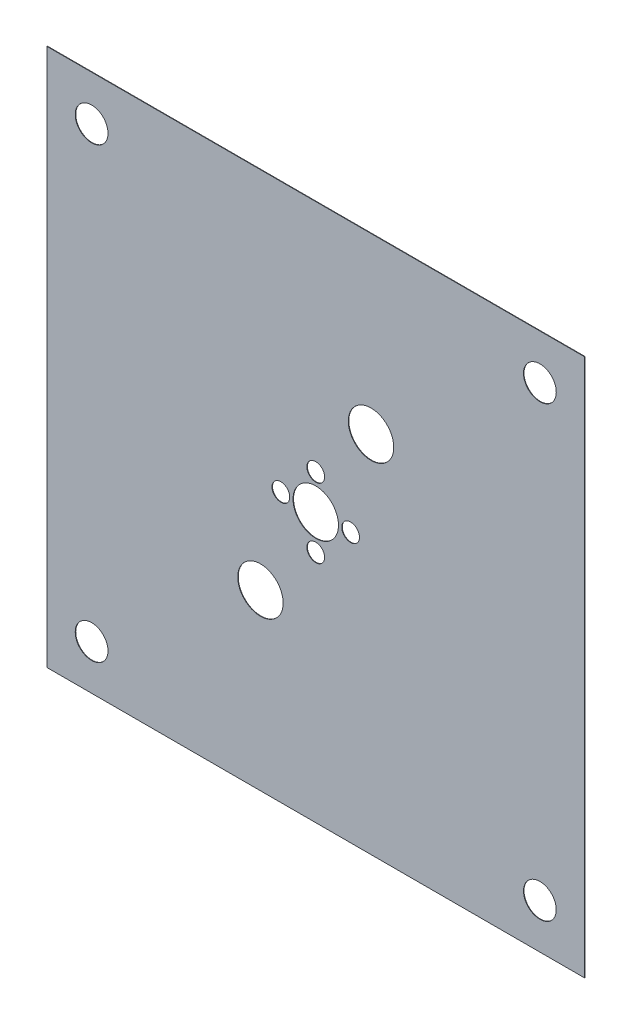
ISO-10303-21;
HEADER;
FILE_DESCRIPTION(('STEP AP214'),'2;1');
FILE_NAME('part.step','',(''),(''),'','','');
FILE_SCHEMA(('AUTOMOTIVE_DESIGN { 1 0 10303 214 1 1 1 1 }'));
ENDSEC;
DATA;
#1=APPLICATION_CONTEXT('core data for automotive mechanical design processes');
#2=APPLICATION_PROTOCOL_DEFINITION('international standard','automotive_design',2000,#1);
#3=PRODUCT_CONTEXT('',#1,'mechanical');
#4=PRODUCT('Part','Part','',(#3));
#5=PRODUCT_RELATED_PRODUCT_CATEGORY('part','',(#4));
#6=PRODUCT_DEFINITION_FORMATION('','',#4);
#7=PRODUCT_DEFINITION_CONTEXT('part definition',#1,'design');
#8=PRODUCT_DEFINITION('design','',#6,#7);
#9=PRODUCT_DEFINITION_SHAPE('','',#8);
#10=(LENGTH_UNIT() NAMED_UNIT(*) SI_UNIT(.MILLI.,.METRE.));
#11=(NAMED_UNIT(*) PLANE_ANGLE_UNIT() SI_UNIT($,.RADIAN.));
#12=(NAMED_UNIT(*) SI_UNIT($,.STERADIAN.) SOLID_ANGLE_UNIT());
#13=UNCERTAINTY_MEASURE_WITH_UNIT(LENGTH_MEASURE(1.E-05),#10,'distance_accuracy_value','');
#14=(GEOMETRIC_REPRESENTATION_CONTEXT(3) GLOBAL_UNCERTAINTY_ASSIGNED_CONTEXT((#13)) GLOBAL_UNIT_ASSIGNED_CONTEXT((#10,
#11,#12)) REPRESENTATION_CONTEXT('',''));
#15=CARTESIAN_POINT('',(0.,0.,0.));
#16=DIRECTION('',(0.,0.,1.));
#17=DIRECTION('',(1.,0.,0.));
#18=AXIS2_PLACEMENT_3D('',#15,#16,#17);
#19=CARTESIAN_POINT('',(0.,0.,2.));
#20=DIRECTION('',(0.,0.,1.));
#21=DIRECTION('',(1.,0.,0.));
#22=AXIS2_PLACEMENT_3D('',#19,#20,#21);
#23=PLANE('',#22);
#24=CARTESIAN_POINT('',(140.,-7.7715611723761E-13,2.));
#25=DIRECTION('',(0.,0.,1.));
#26=DIRECTION('',(1.,0.,0.));
#27=AXIS2_PLACEMENT_3D('',#24,#25,#26);
#28=CIRCLE('',#27,35.6375000000003);
#29=CARTESIAN_POINT('',(175.637500000001,-7.7715611723761E-13,2.));
#30=VERTEX_POINT('',#29);
#31=EDGE_CURVE('E169',#30,#30,#28,.T.);
#32=ORIENTED_EDGE('',*,*,#31,.F.);
#33=EDGE_LOOP('',(#32));
#34=FACE_BOUND('',#33,.T.);
#35=CARTESIAN_POINT('',(-900.,-900.,2.));
#36=DIRECTION('',(0.,0.,1.));
#37=DIRECTION('',(-1.,0.,0.));
#38=AXIS2_PLACEMENT_3D('',#35,#36,#37);
#39=CIRCLE('',#38,65.8);
#40=CARTESIAN_POINT('',(-965.8,-900.,2.));
#41=VERTEX_POINT('',#40);
#42=EDGE_CURVE('E157',#41,#41,#39,.T.);
#43=ORIENTED_EDGE('',*,*,#42,.F.);
#44=EDGE_LOOP('',(#43));
#45=FACE_BOUND('',#44,.T.);
#46=CARTESIAN_POINT('',(900.,-899.999999999999,2.));
#47=DIRECTION('',(0.,0.,1.));
#48=DIRECTION('',(-1.,0.,0.));
#49=AXIS2_PLACEMENT_3D('',#46,#47,#48);
#50=CIRCLE('',#49,65.7999999999997);
#51=CARTESIAN_POINT('',(834.2,-899.999999999999,2.));
#52=VERTEX_POINT('',#51);
#53=EDGE_CURVE('E145',#52,#52,#50,.T.);
#54=ORIENTED_EDGE('',*,*,#53,.F.);
#55=EDGE_LOOP('',(#54));
#56=FACE_BOUND('',#55,.T.);
#57=CARTESIAN_POINT('',(-222.,-382.,2.));
#58=DIRECTION('',(0.,0.,1.));
#59=DIRECTION('',(1.,0.,0.));
#60=AXIS2_PLACEMENT_3D('',#57,#58,#59);
#61=CIRCLE('',#60,91.2);
#62=CARTESIAN_POINT('',(-130.8,-382.,2.));
#63=VERTEX_POINT('',#62);
#64=EDGE_CURVE('E133',#63,#63,#61,.T.);
#65=ORIENTED_EDGE('',*,*,#64,.F.);
#66=EDGE_LOOP('',(#65));
#67=FACE_BOUND('',#66,.T.);
#68=CARTESIAN_POINT('',(1.15116799119851E-13,140.,2.));
#69=DIRECTION('',(0.,0.,1.));
#70=DIRECTION('',(1.,0.,0.));
#71=AXIS2_PLACEMENT_3D('',#68,#69,#70);
#72=CIRCLE('',#71,35.6375);
#73=CARTESIAN_POINT('',(35.6375000000001,140.,2.));
#74=VERTEX_POINT('',#73);
#75=EDGE_CURVE('E121',#74,#74,#72,.T.);
#76=ORIENTED_EDGE('',*,*,#75,.F.);
#77=EDGE_LOOP('',(#76));
#78=FACE_BOUND('',#77,.T.);
#79=DIRECTION('',(0.,1.,0.));
#80=VECTOR('',#79,1.);
#81=CARTESIAN_POINT('',(1080.,1080.,2.));
#82=LINE('',#81,#80);
#83=CARTESIAN_POINT('',(1080.,-1080.,2.));
#84=VERTEX_POINT('',#83);
#85=CARTESIAN_POINT('',(1080.,1080.,2.));
#86=VERTEX_POINT('',#85);
#87=EDGE_CURVE('E91',#84,#86,#82,.T.);
#88=ORIENTED_EDGE('',*,*,#87,.T.);
#89=DIRECTION('',(-1.,0.,0.));
#90=VECTOR('',#89,1.);
#91=CARTESIAN_POINT('',(-1080.,1080.,2.));
#92=LINE('',#91,#90);
#93=CARTESIAN_POINT('',(-1080.,1080.,2.));
#94=VERTEX_POINT('',#93);
#95=EDGE_CURVE('E86',#86,#94,#92,.T.);
#96=ORIENTED_EDGE('',*,*,#95,.T.);
#97=DIRECTION('',(0.,-1.,0.));
#98=VECTOR('',#97,1.);
#99=CARTESIAN_POINT('',(-1080.,1080.,2.));
#100=LINE('',#99,#98);
#101=CARTESIAN_POINT('',(-1080.,-1080.,2.));
#102=VERTEX_POINT('',#101);
#103=EDGE_CURVE('E89',#94,#102,#100,.T.);
#104=ORIENTED_EDGE('',*,*,#103,.T.);
#105=DIRECTION('',(1.,0.,0.));
#106=VECTOR('',#105,1.);
#107=CARTESIAN_POINT('',(-1080.,-1080.,2.));
#108=LINE('',#107,#106);
#109=EDGE_CURVE('E56',#102,#84,#108,.T.);
#110=ORIENTED_EDGE('',*,*,#109,.T.);
#111=EDGE_LOOP('',(#88,#96,#104,#110));
#112=FACE_BOUND('',#111,.T.);
#113=CARTESIAN_POINT('',(-2.22044604925031E-13,0.,2.));
#114=DIRECTION('',(0.,0.,1.));
#115=DIRECTION('',(1.,0.,0.));
#116=AXIS2_PLACEMENT_3D('',#113,#114,#115);
#117=CIRCLE('',#116,91.2);
#118=CARTESIAN_POINT('',(91.1999999999998,0.,2.));
#119=VERTEX_POINT('',#118);
#120=EDGE_CURVE('E106',#119,#119,#117,.T.);
#121=ORIENTED_EDGE('',*,*,#120,.F.);
#122=EDGE_LOOP('',(#121));
#123=FACE_BOUND('',#122,.T.);
#124=CARTESIAN_POINT('',(222.,382.,2.));
#125=DIRECTION('',(0.,0.,1.));
#126=DIRECTION('',(1.,0.,0.));
#127=AXIS2_PLACEMENT_3D('',#124,#125,#126);
#128=CIRCLE('',#127,91.2);
#129=CARTESIAN_POINT('',(313.2,382.,2.));
#130=VERTEX_POINT('',#129);
#131=EDGE_CURVE('E127',#130,#130,#128,.T.);
#132=ORIENTED_EDGE('',*,*,#131,.F.);
#133=EDGE_LOOP('',(#132));
#134=FACE_BOUND('',#133,.T.);
#135=CARTESIAN_POINT('',(-900.,900.,2.));
#136=DIRECTION('',(0.,0.,1.));
#137=DIRECTION('',(1.,0.,0.));
#138=AXIS2_PLACEMENT_3D('',#135,#136,#137);
#139=CIRCLE('',#138,65.8);
#140=CARTESIAN_POINT('',(-834.2,900.,2.));
#141=VERTEX_POINT('',#140);
#142=EDGE_CURVE('E139',#141,#141,#139,.T.);
#143=ORIENTED_EDGE('',*,*,#142,.F.);
#144=EDGE_LOOP('',(#143));
#145=FACE_BOUND('',#144,.T.);
#146=CARTESIAN_POINT('',(900.,899.999999999999,2.));
#147=DIRECTION('',(0.,0.,1.));
#148=DIRECTION('',(1.,0.,0.));
#149=AXIS2_PLACEMENT_3D('',#146,#147,#148);
#150=CIRCLE('',#149,65.7999999999997);
#151=CARTESIAN_POINT('',(965.799999999999,899.999999999999,2.));
#152=VERTEX_POINT('',#151);
#153=EDGE_CURVE('E151',#152,#152,#150,.T.);
#154=ORIENTED_EDGE('',*,*,#153,.F.);
#155=EDGE_LOOP('',(#154));
#156=FACE_BOUND('',#155,.T.);
#157=CARTESIAN_POINT('',(1.15116799119851E-13,-140.,2.));
#158=DIRECTION('',(0.,0.,1.));
#159=DIRECTION('',(-1.,0.,0.));
#160=AXIS2_PLACEMENT_3D('',#157,#158,#159);
#161=CIRCLE('',#160,35.6375);
#162=CARTESIAN_POINT('',(-35.6374999999999,-140.,2.));
#163=VERTEX_POINT('',#162);
#164=EDGE_CURVE('E163',#163,#163,#161,.T.);
#165=ORIENTED_EDGE('',*,*,#164,.F.);
#166=EDGE_LOOP('',(#165));
#167=FACE_BOUND('',#166,.T.);
#168=CARTESIAN_POINT('',(-140.,-1.22124532708767E-12,2.));
#169=DIRECTION('',(0.,0.,1.));
#170=DIRECTION('',(-1.,0.,0.));
#171=AXIS2_PLACEMENT_3D('',#168,#169,#170);
#172=CIRCLE('',#171,35.6375);
#173=CARTESIAN_POINT('',(-175.6375,-1.22124532708767E-12,2.));
#174=VERTEX_POINT('',#173);
#175=EDGE_CURVE('E175',#174,#174,#172,.T.);
#176=ORIENTED_EDGE('',*,*,#175,.F.);
#177=EDGE_LOOP('',(#176));
#178=FACE_BOUND('',#177,.T.);
#179=ADVANCED_FACE('F39',(#34,#45,#56,#67,#78,#112,#123,#134,#145,#156,#167,#178),#23,.T.);
#180=CARTESIAN_POINT('',(0.,0.,0.));
#181=DIRECTION('',(0.,0.,1.));
#182=DIRECTION('',(1.,0.,0.));
#183=AXIS2_PLACEMENT_3D('',#180,#181,#182);
#184=PLANE('',#183);
#185=DIRECTION('',(0.,1.,0.));
#186=VECTOR('',#185,1.);
#187=CARTESIAN_POINT('',(1080.,1080.,0.));
#188=LINE('',#187,#186);
#189=CARTESIAN_POINT('',(1080.,-1080.,0.));
#190=VERTEX_POINT('',#189);
#191=CARTESIAN_POINT('',(1080.,1080.,0.));
#192=VERTEX_POINT('',#191);
#193=EDGE_CURVE('E103',#190,#192,#188,.T.);
#194=ORIENTED_EDGE('',*,*,#193,.F.);
#195=DIRECTION('',(1.,0.,0.));
#196=VECTOR('',#195,1.);
#197=CARTESIAN_POINT('',(-1080.,-1080.,0.));
#198=LINE('',#197,#196);
#199=CARTESIAN_POINT('',(-1080.,-1080.,0.));
#200=VERTEX_POINT('',#199);
#201=EDGE_CURVE('E79',#200,#190,#198,.T.);
#202=ORIENTED_EDGE('',*,*,#201,.F.);
#203=DIRECTION('',(0.,-1.,0.));
#204=VECTOR('',#203,1.);
#205=CARTESIAN_POINT('',(-1080.,1080.,0.));
#206=LINE('',#205,#204);
#207=CARTESIAN_POINT('',(-1080.,1080.,0.));
#208=VERTEX_POINT('',#207);
#209=EDGE_CURVE('E73',#208,#200,#206,.T.);
#210=ORIENTED_EDGE('',*,*,#209,.F.);
#211=DIRECTION('',(-1.,0.,0.));
#212=VECTOR('',#211,1.);
#213=CARTESIAN_POINT('',(-1080.,1080.,0.));
#214=LINE('',#213,#212);
#215=EDGE_CURVE('E95',#192,#208,#214,.T.);
#216=ORIENTED_EDGE('',*,*,#215,.F.);
#217=EDGE_LOOP('',(#194,#202,#210,#216));
#218=FACE_BOUND('',#217,.T.);
#219=CARTESIAN_POINT('',(-2.22044604925031E-13,0.,0.));
#220=DIRECTION('',(0.,0.,1.));
#221=DIRECTION('',(1.,0.,0.));
#222=AXIS2_PLACEMENT_3D('',#219,#220,#221);
#223=CIRCLE('',#222,91.2);
#224=CARTESIAN_POINT('',(91.1999999999998,0.,0.));
#225=VERTEX_POINT('',#224);
#226=EDGE_CURVE('E118',#225,#225,#223,.T.);
#227=ORIENTED_EDGE('',*,*,#226,.T.);
#228=EDGE_LOOP('',(#227));
#229=FACE_BOUND('',#228,.T.);
#230=CARTESIAN_POINT('',(1.15116799119851E-13,140.,0.));
#231=DIRECTION('',(0.,0.,1.));
#232=DIRECTION('',(1.,0.,0.));
#233=AXIS2_PLACEMENT_3D('',#230,#231,#232);
#234=CIRCLE('',#233,35.6375);
#235=CARTESIAN_POINT('',(35.6375000000001,140.,0.));
#236=VERTEX_POINT('',#235);
#237=EDGE_CURVE('E124',#236,#236,#234,.T.);
#238=ORIENTED_EDGE('',*,*,#237,.T.);
#239=EDGE_LOOP('',(#238));
#240=FACE_BOUND('',#239,.T.);
#241=CARTESIAN_POINT('',(222.,382.,0.));
#242=DIRECTION('',(0.,0.,1.));
#243=DIRECTION('',(1.,0.,0.));
#244=AXIS2_PLACEMENT_3D('',#241,#242,#243);
#245=CIRCLE('',#244,91.2);
#246=CARTESIAN_POINT('',(313.2,382.,0.));
#247=VERTEX_POINT('',#246);
#248=EDGE_CURVE('E130',#247,#247,#245,.T.);
#249=ORIENTED_EDGE('',*,*,#248,.T.);
#250=EDGE_LOOP('',(#249));
#251=FACE_BOUND('',#250,.T.);
#252=CARTESIAN_POINT('',(-222.,-382.,0.));
#253=DIRECTION('',(0.,0.,1.));
#254=DIRECTION('',(1.,0.,0.));
#255=AXIS2_PLACEMENT_3D('',#252,#253,#254);
#256=CIRCLE('',#255,91.2);
#257=CARTESIAN_POINT('',(-130.8,-382.,0.));
#258=VERTEX_POINT('',#257);
#259=EDGE_CURVE('E136',#258,#258,#256,.T.);
#260=ORIENTED_EDGE('',*,*,#259,.T.);
#261=EDGE_LOOP('',(#260));
#262=FACE_BOUND('',#261,.T.);
#263=CARTESIAN_POINT('',(-900.,900.,0.));
#264=DIRECTION('',(0.,0.,1.));
#265=DIRECTION('',(1.,0.,0.));
#266=AXIS2_PLACEMENT_3D('',#263,#264,#265);
#267=CIRCLE('',#266,65.8);
#268=CARTESIAN_POINT('',(-834.2,900.,0.));
#269=VERTEX_POINT('',#268);
#270=EDGE_CURVE('E142',#269,#269,#267,.T.);
#271=ORIENTED_EDGE('',*,*,#270,.T.);
#272=EDGE_LOOP('',(#271));
#273=FACE_BOUND('',#272,.T.);
#274=CARTESIAN_POINT('',(900.,-899.999999999999,0.));
#275=DIRECTION('',(0.,0.,1.));
#276=DIRECTION('',(-1.,0.,0.));
#277=AXIS2_PLACEMENT_3D('',#274,#275,#276);
#278=CIRCLE('',#277,65.7999999999997);
#279=CARTESIAN_POINT('',(834.2,-899.999999999999,0.));
#280=VERTEX_POINT('',#279);
#281=EDGE_CURVE('E148',#280,#280,#278,.T.);
#282=ORIENTED_EDGE('',*,*,#281,.T.);
#283=EDGE_LOOP('',(#282));
#284=FACE_BOUND('',#283,.T.);
#285=CARTESIAN_POINT('',(900.,899.999999999999,0.));
#286=DIRECTION('',(0.,0.,1.));
#287=DIRECTION('',(1.,0.,0.));
#288=AXIS2_PLACEMENT_3D('',#285,#286,#287);
#289=CIRCLE('',#288,65.7999999999997);
#290=CARTESIAN_POINT('',(965.799999999999,899.999999999999,0.));
#291=VERTEX_POINT('',#290);
#292=EDGE_CURVE('E154',#291,#291,#289,.T.);
#293=ORIENTED_EDGE('',*,*,#292,.T.);
#294=EDGE_LOOP('',(#293));
#295=FACE_BOUND('',#294,.T.);
#296=CARTESIAN_POINT('',(-900.,-900.,0.));
#297=DIRECTION('',(0.,0.,1.));
#298=DIRECTION('',(-1.,0.,0.));
#299=AXIS2_PLACEMENT_3D('',#296,#297,#298);
#300=CIRCLE('',#299,65.8);
#301=CARTESIAN_POINT('',(-965.8,-900.,0.));
#302=VERTEX_POINT('',#301);
#303=EDGE_CURVE('E160',#302,#302,#300,.T.);
#304=ORIENTED_EDGE('',*,*,#303,.T.);
#305=EDGE_LOOP('',(#304));
#306=FACE_BOUND('',#305,.T.);
#307=CARTESIAN_POINT('',(1.15116799119851E-13,-140.,0.));
#308=DIRECTION('',(0.,0.,1.));
#309=DIRECTION('',(-1.,0.,0.));
#310=AXIS2_PLACEMENT_3D('',#307,#308,#309);
#311=CIRCLE('',#310,35.6375);
#312=CARTESIAN_POINT('',(-35.6374999999999,-140.,0.));
#313=VERTEX_POINT('',#312);
#314=EDGE_CURVE('E166',#313,#313,#311,.T.);
#315=ORIENTED_EDGE('',*,*,#314,.T.);
#316=EDGE_LOOP('',(#315));
#317=FACE_BOUND('',#316,.T.);
#318=CARTESIAN_POINT('',(140.,-7.7715611723761E-13,0.));
#319=DIRECTION('',(0.,0.,1.));
#320=DIRECTION('',(1.,0.,0.));
#321=AXIS2_PLACEMENT_3D('',#318,#319,#320);
#322=CIRCLE('',#321,35.6375000000003);
#323=CARTESIAN_POINT('',(175.637500000001,-7.7715611723761E-13,0.));
#324=VERTEX_POINT('',#323);
#325=EDGE_CURVE('E172',#324,#324,#322,.T.);
#326=ORIENTED_EDGE('',*,*,#325,.T.);
#327=EDGE_LOOP('',(#326));
#328=FACE_BOUND('',#327,.T.);
#329=CARTESIAN_POINT('',(-140.,-1.22124532708767E-12,0.));
#330=DIRECTION('',(0.,0.,1.));
#331=DIRECTION('',(-1.,0.,0.));
#332=AXIS2_PLACEMENT_3D('',#329,#330,#331);
#333=CIRCLE('',#332,35.6375);
#334=CARTESIAN_POINT('',(-175.6375,-1.22124532708767E-12,0.));
#335=VERTEX_POINT('',#334);
#336=EDGE_CURVE('E178',#335,#335,#333,.T.);
#337=ORIENTED_EDGE('',*,*,#336,.T.);
#338=EDGE_LOOP('',(#337));
#339=FACE_BOUND('',#338,.T.);
#340=ADVANCED_FACE('F114',(#218,#229,#240,#251,#262,#273,#284,#295,#306,#317,#328,#339),#184,.F.);
#341=CARTESIAN_POINT('',(1080.,1080.,2.));
#342=DIRECTION('',(-1.,0.,0.));
#343=DIRECTION('',(0.,-1.,0.));
#344=AXIS2_PLACEMENT_3D('',#341,#342,#343);
#345=PLANE('',#344);
#346=ORIENTED_EDGE('',*,*,#193,.T.);
#347=DIRECTION('',(0.,0.,-1.));
#348=VECTOR('',#347,1.);
#349=CARTESIAN_POINT('',(1080.,1080.,2.));
#350=LINE('',#349,#348);
#351=EDGE_CURVE('E11',#86,#192,#350,.T.);
#352=ORIENTED_EDGE('',*,*,#351,.F.);
#353=ORIENTED_EDGE('',*,*,#87,.F.);
#354=DIRECTION('',(0.,0.,-1.));
#355=VECTOR('',#354,1.);
#356=CARTESIAN_POINT('',(1080.,-1080.,2.));
#357=LINE('',#356,#355);
#358=EDGE_CURVE('E99',#84,#190,#357,.T.);
#359=ORIENTED_EDGE('',*,*,#358,.T.);
#360=EDGE_LOOP('',(#346,#352,#353,#359));
#361=FACE_BOUND('',#360,.T.);
#362=ADVANCED_FACE('F41',(#361),#345,.F.);
#363=CARTESIAN_POINT('',(-1080.,1080.,2.));
#364=DIRECTION('',(0.,-1.,0.));
#365=DIRECTION('',(0.,0.,-1.));
#366=AXIS2_PLACEMENT_3D('',#363,#364,#365);
#367=PLANE('',#366);
#368=ORIENTED_EDGE('',*,*,#215,.T.);
#369=DIRECTION('',(0.,0.,-1.));
#370=VECTOR('',#369,1.);
#371=CARTESIAN_POINT('',(-1080.,1080.,2.));
#372=LINE('',#371,#370);
#373=EDGE_CURVE('E48',#94,#208,#372,.T.);
#374=ORIENTED_EDGE('',*,*,#373,.F.);
#375=ORIENTED_EDGE('',*,*,#95,.F.);
#376=ORIENTED_EDGE('',*,*,#351,.T.);
#377=EDGE_LOOP('',(#368,#374,#375,#376));
#378=FACE_BOUND('',#377,.T.);
#379=ADVANCED_FACE('F94',(#378),#367,.F.);
#380=CARTESIAN_POINT('',(-1080.,1080.,2.));
#381=DIRECTION('',(1.,0.,0.));
#382=DIRECTION('',(0.,1.,0.));
#383=AXIS2_PLACEMENT_3D('',#380,#381,#382);
#384=PLANE('',#383);
#385=ORIENTED_EDGE('',*,*,#209,.T.);
#386=DIRECTION('',(0.,0.,-1.));
#387=VECTOR('',#386,1.);
#388=CARTESIAN_POINT('',(-1080.,-1080.,2.));
#389=LINE('',#388,#387);
#390=EDGE_CURVE('E96',#102,#200,#389,.T.);
#391=ORIENTED_EDGE('',*,*,#390,.F.);
#392=ORIENTED_EDGE('',*,*,#103,.F.);
#393=ORIENTED_EDGE('',*,*,#373,.T.);
#394=EDGE_LOOP('',(#385,#391,#392,#393));
#395=FACE_BOUND('',#394,.T.);
#396=ADVANCED_FACE('F97',(#395),#384,.F.);
#397=CARTESIAN_POINT('',(-1080.,-1080.,2.));
#398=DIRECTION('',(0.,1.,0.));
#399=DIRECTION('',(0.,0.,1.));
#400=AXIS2_PLACEMENT_3D('',#397,#398,#399);
#401=PLANE('',#400);
#402=ORIENTED_EDGE('',*,*,#201,.T.);
#403=ORIENTED_EDGE('',*,*,#358,.F.);
#404=ORIENTED_EDGE('',*,*,#109,.F.);
#405=ORIENTED_EDGE('',*,*,#390,.T.);
#406=EDGE_LOOP('',(#402,#403,#404,#405));
#407=FACE_BOUND('',#406,.T.);
#408=ADVANCED_FACE('F111',(#407),#401,.F.);
#409=CARTESIAN_POINT('',(-2.22044604925031E-13,0.,2.));
#410=DIRECTION('',(0.,0.,-1.));
#411=DIRECTION('',(-1.,0.,0.));
#412=AXIS2_PLACEMENT_3D('',#409,#410,#411);
#413=CYLINDRICAL_SURFACE('',#412,91.2);
#414=ORIENTED_EDGE('',*,*,#120,.T.);
#415=EDGE_LOOP('',(#414));
#416=FACE_BOUND('',#415,.T.);
#417=ORIENTED_EDGE('',*,*,#226,.F.);
#418=EDGE_LOOP('',(#417));
#419=FACE_BOUND('',#418,.T.);
#420=ADVANCED_FACE('F197',(#416,#419),#413,.F.);
#421=CARTESIAN_POINT('',(1.15116799119851E-13,140.,2.));
#422=DIRECTION('',(0.,0.,-1.));
#423=DIRECTION('',(-1.,0.,0.));
#424=AXIS2_PLACEMENT_3D('',#421,#422,#423);
#425=CYLINDRICAL_SURFACE('',#424,35.6375);
#426=ORIENTED_EDGE('',*,*,#75,.T.);
#427=EDGE_LOOP('',(#426));
#428=FACE_BOUND('',#427,.T.);
#429=ORIENTED_EDGE('',*,*,#237,.F.);
#430=EDGE_LOOP('',(#429));
#431=FACE_BOUND('',#430,.T.);
#432=ADVANCED_FACE('F251',(#428,#431),#425,.F.);
#433=CARTESIAN_POINT('',(222.,382.,2.));
#434=DIRECTION('',(0.,0.,-1.));
#435=DIRECTION('',(-1.,0.,0.));
#436=AXIS2_PLACEMENT_3D('',#433,#434,#435);
#437=CYLINDRICAL_SURFACE('',#436,91.2);
#438=ORIENTED_EDGE('',*,*,#131,.T.);
#439=EDGE_LOOP('',(#438));
#440=FACE_BOUND('',#439,.T.);
#441=ORIENTED_EDGE('',*,*,#248,.F.);
#442=EDGE_LOOP('',(#441));
#443=FACE_BOUND('',#442,.T.);
#444=ADVANCED_FACE('F260',(#440,#443),#437,.F.);
#445=CARTESIAN_POINT('',(-222.,-382.,2.));
#446=DIRECTION('',(0.,0.,-1.));
#447=DIRECTION('',(-1.,0.,0.));
#448=AXIS2_PLACEMENT_3D('',#445,#446,#447);
#449=CYLINDRICAL_SURFACE('',#448,91.2);
#450=ORIENTED_EDGE('',*,*,#64,.T.);
#451=EDGE_LOOP('',(#450));
#452=FACE_BOUND('',#451,.T.);
#453=ORIENTED_EDGE('',*,*,#259,.F.);
#454=EDGE_LOOP('',(#453));
#455=FACE_BOUND('',#454,.T.);
#456=ADVANCED_FACE('F269',(#452,#455),#449,.F.);
#457=CARTESIAN_POINT('',(-900.,900.,2.));
#458=DIRECTION('',(0.,0.,-1.));
#459=DIRECTION('',(-1.,0.,0.));
#460=AXIS2_PLACEMENT_3D('',#457,#458,#459);
#461=CYLINDRICAL_SURFACE('',#460,65.8);
#462=ORIENTED_EDGE('',*,*,#142,.T.);
#463=EDGE_LOOP('',(#462));
#464=FACE_BOUND('',#463,.T.);
#465=ORIENTED_EDGE('',*,*,#270,.F.);
#466=EDGE_LOOP('',(#465));
#467=FACE_BOUND('',#466,.T.);
#468=ADVANCED_FACE('F279',(#464,#467),#461,.F.);
#469=CARTESIAN_POINT('',(900.,-899.999999999999,2.));
#470=DIRECTION('',(0.,0.,-1.));
#471=DIRECTION('',(-1.,0.,0.));
#472=AXIS2_PLACEMENT_3D('',#469,#470,#471);
#473=CYLINDRICAL_SURFACE('',#472,65.7999999999997);
#474=ORIENTED_EDGE('',*,*,#53,.T.);
#475=EDGE_LOOP('',(#474));
#476=FACE_BOUND('',#475,.T.);
#477=ORIENTED_EDGE('',*,*,#281,.F.);
#478=EDGE_LOOP('',(#477));
#479=FACE_BOUND('',#478,.T.);
#480=ADVANCED_FACE('F289',(#476,#479),#473,.F.);
#481=CARTESIAN_POINT('',(900.,899.999999999999,2.));
#482=DIRECTION('',(0.,0.,-1.));
#483=DIRECTION('',(-1.,0.,0.));
#484=AXIS2_PLACEMENT_3D('',#481,#482,#483);
#485=CYLINDRICAL_SURFACE('',#484,65.7999999999997);
#486=ORIENTED_EDGE('',*,*,#153,.T.);
#487=EDGE_LOOP('',(#486));
#488=FACE_BOUND('',#487,.T.);
#489=ORIENTED_EDGE('',*,*,#292,.F.);
#490=EDGE_LOOP('',(#489));
#491=FACE_BOUND('',#490,.T.);
#492=ADVANCED_FACE('F299',(#488,#491),#485,.F.);
#493=CARTESIAN_POINT('',(-900.,-900.,2.));
#494=DIRECTION('',(0.,0.,-1.));
#495=DIRECTION('',(-1.,0.,0.));
#496=AXIS2_PLACEMENT_3D('',#493,#494,#495);
#497=CYLINDRICAL_SURFACE('',#496,65.8);
#498=ORIENTED_EDGE('',*,*,#42,.T.);
#499=EDGE_LOOP('',(#498));
#500=FACE_BOUND('',#499,.T.);
#501=ORIENTED_EDGE('',*,*,#303,.F.);
#502=EDGE_LOOP('',(#501));
#503=FACE_BOUND('',#502,.T.);
#504=ADVANCED_FACE('F309',(#500,#503),#497,.F.);
#505=CARTESIAN_POINT('',(1.15116799119851E-13,-140.,2.));
#506=DIRECTION('',(0.,0.,-1.));
#507=DIRECTION('',(-1.,0.,0.));
#508=AXIS2_PLACEMENT_3D('',#505,#506,#507);
#509=CYLINDRICAL_SURFACE('',#508,35.6375);
#510=ORIENTED_EDGE('',*,*,#164,.T.);
#511=EDGE_LOOP('',(#510));
#512=FACE_BOUND('',#511,.T.);
#513=ORIENTED_EDGE('',*,*,#314,.F.);
#514=EDGE_LOOP('',(#513));
#515=FACE_BOUND('',#514,.T.);
#516=ADVANCED_FACE('F319',(#512,#515),#509,.F.);
#517=CARTESIAN_POINT('',(140.,-7.7715611723761E-13,2.));
#518=DIRECTION('',(0.,0.,-1.));
#519=DIRECTION('',(-1.,0.,0.));
#520=AXIS2_PLACEMENT_3D('',#517,#518,#519);
#521=CYLINDRICAL_SURFACE('',#520,35.6375000000003);
#522=ORIENTED_EDGE('',*,*,#31,.T.);
#523=EDGE_LOOP('',(#522));
#524=FACE_BOUND('',#523,.T.);
#525=ORIENTED_EDGE('',*,*,#325,.F.);
#526=EDGE_LOOP('',(#525));
#527=FACE_BOUND('',#526,.T.);
#528=ADVANCED_FACE('F329',(#524,#527),#521,.F.);
#529=CARTESIAN_POINT('',(-140.,-1.22124532708767E-12,2.));
#530=DIRECTION('',(0.,0.,-1.));
#531=DIRECTION('',(-1.,0.,0.));
#532=AXIS2_PLACEMENT_3D('',#529,#530,#531);
#533=CYLINDRICAL_SURFACE('',#532,35.6375);
#534=ORIENTED_EDGE('',*,*,#175,.T.);
#535=EDGE_LOOP('',(#534));
#536=FACE_BOUND('',#535,.T.);
#537=ORIENTED_EDGE('',*,*,#336,.F.);
#538=EDGE_LOOP('',(#537));
#539=FACE_BOUND('',#538,.T.);
#540=ADVANCED_FACE('F184',(#536,#539),#533,.F.);
#541=CLOSED_SHELL('',(#179,#340,#362,#379,#396,#408,#420,#432,#444,#456,#468,#480,#492,#504,
#516,#528,#540));
#542=MANIFOLD_SOLID_BREP('B2',#541);
#543=ADVANCED_BREP_SHAPE_REPRESENTATION('',(#18,#542),#14);
#544=SHAPE_DEFINITION_REPRESENTATION(#9,#543);
ENDSEC;
END-ISO-10303-21;
